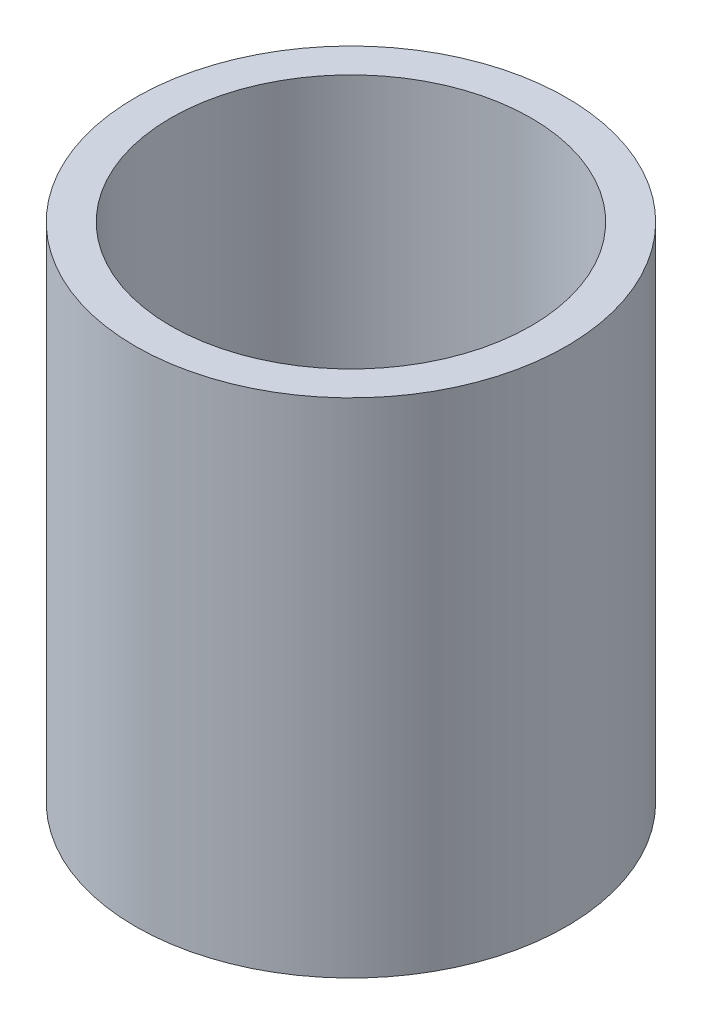
ISO-10303-21;
HEADER;
FILE_DESCRIPTION(('STEP AP214'),'2;1');
FILE_NAME('part.step','',(''),(''),'','','');
FILE_SCHEMA(('AUTOMOTIVE_DESIGN { 1 0 10303 214 1 1 1 1 }'));
ENDSEC;
DATA;
#1=APPLICATION_CONTEXT('core data for automotive mechanical design processes');
#2=APPLICATION_PROTOCOL_DEFINITION('international standard','automotive_design',2000,#1);
#3=PRODUCT_CONTEXT('',#1,'mechanical');
#4=PRODUCT('Part','Part','',(#3));
#5=PRODUCT_RELATED_PRODUCT_CATEGORY('part','',(#4));
#6=PRODUCT_DEFINITION_FORMATION('','',#4);
#7=PRODUCT_DEFINITION_CONTEXT('part definition',#1,'design');
#8=PRODUCT_DEFINITION('design','',#6,#7);
#9=PRODUCT_DEFINITION_SHAPE('','',#8);
#10=(LENGTH_UNIT() NAMED_UNIT(*) SI_UNIT(.MILLI.,.METRE.));
#11=(NAMED_UNIT(*) PLANE_ANGLE_UNIT() SI_UNIT($,.RADIAN.));
#12=(NAMED_UNIT(*) SI_UNIT($,.STERADIAN.) SOLID_ANGLE_UNIT());
#13=UNCERTAINTY_MEASURE_WITH_UNIT(LENGTH_MEASURE(1.E-05),#10,'distance_accuracy_value','');
#14=(GEOMETRIC_REPRESENTATION_CONTEXT(3) GLOBAL_UNCERTAINTY_ASSIGNED_CONTEXT((#13)) GLOBAL_UNIT_ASSIGNED_CONTEXT((#10,
#11,#12)) REPRESENTATION_CONTEXT('',''));
#15=CARTESIAN_POINT('',(0.,0.,0.));
#16=DIRECTION('',(0.,0.,1.));
#17=DIRECTION('',(1.,0.,0.));
#18=AXIS2_PLACEMENT_3D('',#15,#16,#17);
#19=CARTESIAN_POINT('',(0.,46.6354470519255,0.));
#20=DIRECTION('',(0.,-1.,0.));
#21=DIRECTION('',(0.,0.,-1.));
#22=AXIS2_PLACEMENT_3D('',#19,#20,#21);
#23=CYLINDRICAL_SURFACE('',#22,20.);
#24=CARTESIAN_POINT('',(0.,46.6354470519255,0.));
#25=DIRECTION('',(0.,1.,0.));
#26=DIRECTION('',(0.,0.,1.));
#27=AXIS2_PLACEMENT_3D('',#24,#25,#26);
#28=CIRCLE('',#27,20.);
#29=CARTESIAN_POINT('',(0.,46.6354470519255,20.));
#30=VERTEX_POINT('',#29);
#31=EDGE_CURVE('E10',#30,#30,#28,.T.);
#32=ORIENTED_EDGE('',*,*,#31,.F.);
#33=EDGE_LOOP('',(#32));
#34=FACE_BOUND('',#33,.T.);
#35=CARTESIAN_POINT('',(0.,0.,0.));
#36=DIRECTION('',(0.,1.,0.));
#37=DIRECTION('',(0.,0.,1.));
#38=AXIS2_PLACEMENT_3D('',#35,#36,#37);
#39=CIRCLE('',#38,20.);
#40=CARTESIAN_POINT('',(0.,0.,20.));
#41=VERTEX_POINT('',#40);
#42=EDGE_CURVE('E37',#41,#41,#39,.T.);
#43=ORIENTED_EDGE('',*,*,#42,.T.);
#44=EDGE_LOOP('',(#43));
#45=FACE_BOUND('',#44,.T.);
#46=ADVANCED_FACE('F40',(#34,#45),#23,.T.);
#47=CARTESIAN_POINT('',(0.,46.6354470519255,0.));
#48=DIRECTION('',(0.,1.,0.));
#49=DIRECTION('',(0.,0.,1.));
#50=AXIS2_PLACEMENT_3D('',#47,#48,#49);
#51=PLANE('',#50);
#52=CARTESIAN_POINT('',(0.,46.6354470519255,0.));
#53=DIRECTION('',(0.,1.,0.));
#54=DIRECTION('',(0.,0.,1.));
#55=AXIS2_PLACEMENT_3D('',#52,#53,#54);
#56=CIRCLE('',#55,16.7195935940653);
#57=CARTESIAN_POINT('',(0.,46.6354470519255,16.7195935940653));
#58=VERTEX_POINT('',#57);
#59=EDGE_CURVE('E50',#58,#58,#56,.T.);
#60=ORIENTED_EDGE('',*,*,#59,.F.);
#61=EDGE_LOOP('',(#60));
#62=FACE_BOUND('',#61,.T.);
#63=ORIENTED_EDGE('',*,*,#31,.T.);
#64=EDGE_LOOP('',(#63));
#65=FACE_BOUND('',#64,.T.);
#66=ADVANCED_FACE('F59',(#62,#65),#51,.T.);
#67=CARTESIAN_POINT('',(0.,0.,0.));
#68=DIRECTION('',(0.,1.,0.));
#69=DIRECTION('',(0.,0.,1.));
#70=AXIS2_PLACEMENT_3D('',#67,#68,#69);
#71=PLANE('',#70);
#72=CARTESIAN_POINT('',(0.,0.,0.));
#73=DIRECTION('',(0.,1.,0.));
#74=DIRECTION('',(0.,0.,1.));
#75=AXIS2_PLACEMENT_3D('',#72,#73,#74);
#76=CIRCLE('',#75,16.7195935940653);
#77=CARTESIAN_POINT('',(0.,0.,16.7195935940653));
#78=VERTEX_POINT('',#77);
#79=EDGE_CURVE('E47',#78,#78,#76,.T.);
#80=ORIENTED_EDGE('',*,*,#79,.T.);
#81=EDGE_LOOP('',(#80));
#82=FACE_BOUND('',#81,.T.);
#83=ORIENTED_EDGE('',*,*,#42,.F.);
#84=EDGE_LOOP('',(#83));
#85=FACE_BOUND('',#84,.T.);
#86=ADVANCED_FACE('F58',(#82,#85),#71,.F.);
#87=CARTESIAN_POINT('',(0.,46.6354470519255,0.));
#88=DIRECTION('',(0.,-1.,0.));
#89=DIRECTION('',(0.,0.,-1.));
#90=AXIS2_PLACEMENT_3D('',#87,#88,#89);
#91=CYLINDRICAL_SURFACE('',#90,16.7195935940653);
#92=ORIENTED_EDGE('',*,*,#59,.T.);
#93=EDGE_LOOP('',(#92));
#94=FACE_BOUND('',#93,.T.);
#95=ORIENTED_EDGE('',*,*,#79,.F.);
#96=EDGE_LOOP('',(#95));
#97=FACE_BOUND('',#96,.T.);
#98=ADVANCED_FACE('F54',(#94,#97),#91,.F.);
#99=CLOSED_SHELL('',(#46,#66,#86,#98));
#100=MANIFOLD_SOLID_BREP('B2',#99);
#101=ADVANCED_BREP_SHAPE_REPRESENTATION('',(#18,#100),#14);
#102=SHAPE_DEFINITION_REPRESENTATION(#9,#101);
ENDSEC;
END-ISO-10303-21;
